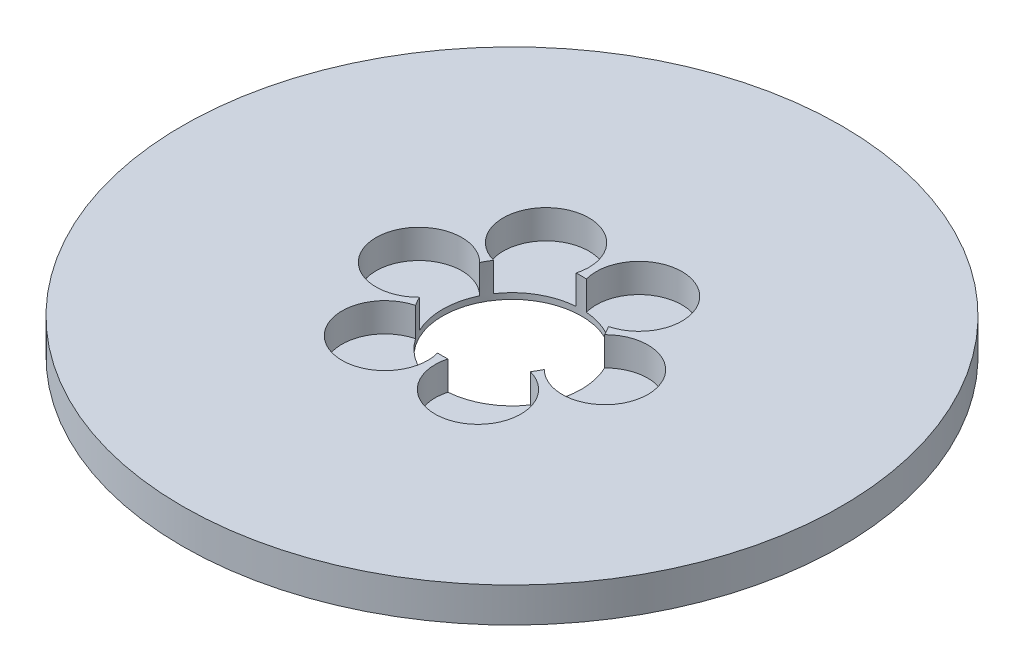
ISO-10303-21;
HEADER;
FILE_DESCRIPTION(('STEP AP214'),'2;1');
FILE_NAME('part.step','',(''),(''),'','','');
FILE_SCHEMA(('AUTOMOTIVE_DESIGN { 1 0 10303 214 1 1 1 1 }'));
ENDSEC;
DATA;
#1=APPLICATION_CONTEXT('core data for automotive mechanical design processes');
#2=APPLICATION_PROTOCOL_DEFINITION('international standard','automotive_design',2000,#1);
#3=PRODUCT_CONTEXT('',#1,'mechanical');
#4=PRODUCT('Part','Part','',(#3));
#5=PRODUCT_RELATED_PRODUCT_CATEGORY('part','',(#4));
#6=PRODUCT_DEFINITION_FORMATION('','',#4);
#7=PRODUCT_DEFINITION_CONTEXT('part definition',#1,'design');
#8=PRODUCT_DEFINITION('design','',#6,#7);
#9=PRODUCT_DEFINITION_SHAPE('','',#8);
#10=(LENGTH_UNIT() NAMED_UNIT(*) SI_UNIT(.MILLI.,.METRE.));
#11=(NAMED_UNIT(*) PLANE_ANGLE_UNIT() SI_UNIT($,.RADIAN.));
#12=(NAMED_UNIT(*) SI_UNIT($,.STERADIAN.) SOLID_ANGLE_UNIT());
#13=UNCERTAINTY_MEASURE_WITH_UNIT(LENGTH_MEASURE(1.E-05),#10,'distance_accuracy_value','');
#14=(GEOMETRIC_REPRESENTATION_CONTEXT(3) GLOBAL_UNCERTAINTY_ASSIGNED_CONTEXT((#13)) GLOBAL_UNIT_ASSIGNED_CONTEXT((#10,
#11,#12)) REPRESENTATION_CONTEXT('',''));
#15=CARTESIAN_POINT('',(0.,0.,0.));
#16=DIRECTION('',(0.,0.,1.));
#17=DIRECTION('',(1.,0.,0.));
#18=AXIS2_PLACEMENT_3D('',#15,#16,#17);
#19=CARTESIAN_POINT('',(0.,5.,0.));
#20=DIRECTION('',(0.,-1.,0.));
#21=DIRECTION('',(0.,0.,-1.));
#22=AXIS2_PLACEMENT_3D('',#19,#20,#21);
#23=CYLINDRICAL_SURFACE('',#22,47.5);
#24=CARTESIAN_POINT('',(0.,5.,0.));
#25=DIRECTION('',(0.,1.,0.));
#26=DIRECTION('',(0.,0.,1.));
#27=AXIS2_PLACEMENT_3D('',#24,#25,#26);
#28=CIRCLE('',#27,47.5);
#29=CARTESIAN_POINT('',(0.,5.,47.5));
#30=VERTEX_POINT('',#29);
#31=EDGE_CURVE('E168',#30,#30,#28,.T.);
#32=ORIENTED_EDGE('',*,*,#31,.F.);
#33=EDGE_LOOP('',(#32));
#34=FACE_BOUND('',#33,.T.);
#35=CARTESIAN_POINT('',(0.,0.,0.));
#36=DIRECTION('',(0.,1.,0.));
#37=DIRECTION('',(0.,0.,1.));
#38=AXIS2_PLACEMENT_3D('',#35,#36,#37);
#39=CIRCLE('',#38,47.5);
#40=CARTESIAN_POINT('',(0.,0.,47.5));
#41=VERTEX_POINT('',#40);
#42=EDGE_CURVE('E158',#41,#41,#39,.T.);
#43=ORIENTED_EDGE('',*,*,#42,.T.);
#44=EDGE_LOOP('',(#43));
#45=FACE_BOUND('',#44,.T.);
#46=ADVANCED_FACE('F39',(#34,#45),#23,.T.);
#47=CARTESIAN_POINT('',(0.,5.,0.));
#48=DIRECTION('',(0.,1.,0.));
#49=DIRECTION('',(0.,0.,1.));
#50=AXIS2_PLACEMENT_3D('',#47,#48,#49);
#51=PLANE('',#50);
#52=CARTESIAN_POINT('',(13.4101402893217,5.,0.));
#53=DIRECTION('',(0.,1.,0.));
#54=DIRECTION('',(0.,0.,-1.));
#55=AXIS2_PLACEMENT_3D('',#52,#53,#54);
#56=CIRCLE('',#55,6.18330857779389);
#57=CARTESIAN_POINT('',(9.0080548151853,5.,4.34222851156143));
#58=VERTEX_POINT('',#57);
#59=CARTESIAN_POINT('',(9.0080548151853,5.,-4.34222851156143));
#60=VERTEX_POINT('',#59);
#61=EDGE_CURVE('E212',#58,#60,#56,.T.);
#62=ORIENTED_EDGE('',*,*,#61,.F.);
#63=CARTESIAN_POINT('',(0.,5.,0.));
#64=DIRECTION('',(0.,1.,0.));
#65=DIRECTION('',(0.,0.,1.));
#66=AXIS2_PLACEMENT_3D('',#63,#64,#65);
#67=CIRCLE('',#66,10.);
#68=CARTESIAN_POINT('',(8.26450760764196,5.,5.63009005285245));
#69=VERTEX_POINT('',#68);
#70=EDGE_CURVE('E156',#69,#58,#67,.T.);
#71=ORIENTED_EDGE('',*,*,#70,.F.);
#72=CARTESIAN_POINT('',(6.70507014466089,5.,11.6135221588657));
#73=DIRECTION('',(0.,1.,0.));
#74=DIRECTION('',(0.866025403784436,0.,-0.500000000000004));
#75=AXIS2_PLACEMENT_3D('',#72,#73,#74);
#76=CIRCLE('',#75,6.18330857779389);
#77=CARTESIAN_POINT('',(0.743547207543411,5.,9.97231856441392));
#78=VERTEX_POINT('',#77);
#79=EDGE_CURVE('E152',#78,#69,#76,.T.);
#80=ORIENTED_EDGE('',*,*,#79,.F.);
#81=CARTESIAN_POINT('',(-0.74354720754334,5.,9.97231856441392));
#82=VERTEX_POINT('',#81);
#83=EDGE_CURVE('E148',#82,#78,#67,.T.);
#84=ORIENTED_EDGE('',*,*,#83,.F.);
#85=CARTESIAN_POINT('',(-6.70507014466081,5.,11.6135221588658));
#86=DIRECTION('',(0.,1.,0.));
#87=DIRECTION('',(0.86602540378444,0.,0.499999999999998));
#88=AXIS2_PLACEMENT_3D('',#85,#86,#87);
#89=CIRCLE('',#88,6.18330857779389);
#90=CARTESIAN_POINT('',(-8.26450760764192,5.,5.63009005285251));
#91=VERTEX_POINT('',#90);
#92=EDGE_CURVE('E127',#91,#82,#89,.T.);
#93=ORIENTED_EDGE('',*,*,#92,.F.);
#94=CARTESIAN_POINT('',(-9.0080548151853,5.,4.34222851156143));
#95=VERTEX_POINT('',#94);
#96=EDGE_CURVE('E154',#95,#91,#67,.T.);
#97=ORIENTED_EDGE('',*,*,#96,.F.);
#98=CARTESIAN_POINT('',(-13.4101402893217,5.,0.));
#99=DIRECTION('',(0.,1.,0.));
#100=DIRECTION('',(0.,0.,1.));
#101=AXIS2_PLACEMENT_3D('',#98,#99,#100);
#102=CIRCLE('',#101,6.18330857779389);
#103=CARTESIAN_POINT('',(-9.0080548151853,5.,-4.34222851156143));
#104=VERTEX_POINT('',#103);
#105=EDGE_CURVE('E163',#104,#95,#102,.T.);
#106=ORIENTED_EDGE('',*,*,#105,.F.);
#107=CARTESIAN_POINT('',(-8.264507607642,5.,-5.6300900528524));
#108=VERTEX_POINT('',#107);
#109=EDGE_CURVE('E157',#108,#104,#67,.T.);
#110=ORIENTED_EDGE('',*,*,#109,.F.);
#111=CARTESIAN_POINT('',(-6.70507014466097,5.,-11.6135221588657));
#112=DIRECTION('',(0.,1.,0.));
#113=DIRECTION('',(-0.866025403784433,0.,0.50000000000001));
#114=AXIS2_PLACEMENT_3D('',#111,#112,#113);
#115=CIRCLE('',#114,6.18330857779389);
#116=CARTESIAN_POINT('',(-0.743547207543479,5.,-9.97231856441391));
#117=VERTEX_POINT('',#116);
#118=EDGE_CURVE('E371',#117,#108,#115,.T.);
#119=ORIENTED_EDGE('',*,*,#118,.F.);
#120=CARTESIAN_POINT('',(0.743547207543271,5.,-9.97231856441393));
#121=VERTEX_POINT('',#120);
#122=EDGE_CURVE('E378',#121,#117,#67,.T.);
#123=ORIENTED_EDGE('',*,*,#122,.F.);
#124=CARTESIAN_POINT('',(6.70507014466073,5.,-11.6135221588658));
#125=DIRECTION('',(0.,1.,0.));
#126=DIRECTION('',(-0.866025403784443,0.,-0.499999999999992));
#127=AXIS2_PLACEMENT_3D('',#124,#125,#126);
#128=CIRCLE('',#127,6.18330857779389);
#129=CARTESIAN_POINT('',(8.26450760764188,5.,-5.63009005285257));
#130=VERTEX_POINT('',#129);
#131=EDGE_CURVE('E392',#130,#121,#128,.T.);
#132=ORIENTED_EDGE('',*,*,#131,.F.);
#133=EDGE_CURVE('E161',#60,#130,#67,.T.);
#134=ORIENTED_EDGE('',*,*,#133,.F.);
#135=EDGE_LOOP('',(#62,#71,#80,#84,#93,#97,#106,#110,#119,#123,#132,#134));
#136=FACE_BOUND('',#135,.T.);
#137=ORIENTED_EDGE('',*,*,#31,.T.);
#138=EDGE_LOOP('',(#137));
#139=FACE_BOUND('',#138,.T.);
#140=ADVANCED_FACE('F151',(#136,#139),#51,.T.);
#141=CARTESIAN_POINT('',(0.,0.,0.));
#142=DIRECTION('',(0.,1.,0.));
#143=DIRECTION('',(0.,0.,1.));
#144=AXIS2_PLACEMENT_3D('',#141,#142,#143);
#145=PLANE('',#144);
#146=CARTESIAN_POINT('',(0.,0.,0.));
#147=DIRECTION('',(0.,1.,0.));
#148=DIRECTION('',(0.,0.,1.));
#149=AXIS2_PLACEMENT_3D('',#146,#147,#148);
#150=CIRCLE('',#149,10.);
#151=CARTESIAN_POINT('',(0.,0.,10.));
#152=VERTEX_POINT('',#151);
#153=EDGE_CURVE('E167',#152,#152,#150,.T.);
#154=ORIENTED_EDGE('',*,*,#153,.T.);
#155=EDGE_LOOP('',(#154));
#156=FACE_BOUND('',#155,.T.);
#157=ORIENTED_EDGE('',*,*,#42,.F.);
#158=EDGE_LOOP('',(#157));
#159=FACE_BOUND('',#158,.T.);
#160=ADVANCED_FACE('F235',(#156,#159),#145,.F.);
#161=CARTESIAN_POINT('',(0.,5.,0.));
#162=DIRECTION('',(0.,-1.,0.));
#163=DIRECTION('',(0.,0.,-1.));
#164=AXIS2_PLACEMENT_3D('',#161,#162,#163);
#165=CYLINDRICAL_SURFACE('',#164,10.);
#166=DIRECTION('',(0.,1.,0.));
#167=VECTOR('',#166,1.);
#168=CARTESIAN_POINT('',(9.0080548151853,2.92207011488759,4.34222851156143));
#169=LINE('',#168,#167);
#170=CARTESIAN_POINT('',(9.0080548151853,0.84414022977518,4.34222851156143));
#171=VERTEX_POINT('',#170);
#172=EDGE_CURVE('E11',#171,#58,#169,.T.);
#173=ORIENTED_EDGE('',*,*,#172,.F.);
#174=CARTESIAN_POINT('',(0.,0.84414022977518,0.));
#175=DIRECTION('',(0.,1.,0.));
#176=DIRECTION('',(0.,0.,1.));
#177=AXIS2_PLACEMENT_3D('',#174,#175,#176);
#178=CIRCLE('',#177,10.);
#179=CARTESIAN_POINT('',(9.0080548151853,0.84414022977518,-4.34222851156143));
#180=VERTEX_POINT('',#179);
#181=EDGE_CURVE('E207',#171,#180,#178,.T.);
#182=ORIENTED_EDGE('',*,*,#181,.T.);
#183=DIRECTION('',(0.,1.,0.));
#184=VECTOR('',#183,1.);
#185=CARTESIAN_POINT('',(9.0080548151853,2.92207011488759,-4.34222851156143));
#186=LINE('',#185,#184);
#187=EDGE_CURVE('E46',#60,#180,#186,.F.);
#188=ORIENTED_EDGE('',*,*,#187,.F.);
#189=ORIENTED_EDGE('',*,*,#133,.T.);
#190=DIRECTION('',(0.,1.,0.));
#191=VECTOR('',#190,1.);
#192=CARTESIAN_POINT('',(8.26450760764188,2.92207011488759,-5.63009005285257));
#193=LINE('',#192,#191);
#194=CARTESIAN_POINT('',(8.26450760764188,0.84414022977518,-5.63009005285257));
#195=VERTEX_POINT('',#194);
#196=EDGE_CURVE('E199',#195,#130,#193,.T.);
#197=ORIENTED_EDGE('',*,*,#196,.F.);
#198=CARTESIAN_POINT('',(0.,0.84414022977518,0.));
#199=DIRECTION('',(0.,1.,0.));
#200=DIRECTION('',(0.,0.,1.));
#201=AXIS2_PLACEMENT_3D('',#198,#199,#200);
#202=CIRCLE('',#201,10.);
#203=CARTESIAN_POINT('',(0.743547207543271,0.84414022977518,-9.97231856441393));
#204=VERTEX_POINT('',#203);
#205=EDGE_CURVE('E193',#195,#204,#202,.T.);
#206=ORIENTED_EDGE('',*,*,#205,.T.);
#207=DIRECTION('',(0.,1.,0.));
#208=VECTOR('',#207,1.);
#209=CARTESIAN_POINT('',(0.743547207543271,2.92207011488759,-9.97231856441392));
#210=LINE('',#209,#208);
#211=EDGE_CURVE('E197',#121,#204,#210,.F.);
#212=ORIENTED_EDGE('',*,*,#211,.F.);
#213=ORIENTED_EDGE('',*,*,#122,.T.);
#214=DIRECTION('',(0.,1.,0.));
#215=VECTOR('',#214,1.);
#216=CARTESIAN_POINT('',(-0.74354720754348,2.92207011488759,-9.97231856441391));
#217=LINE('',#216,#215);
#218=CARTESIAN_POINT('',(-0.743547207543479,0.84414022977518,-9.97231856441391));
#219=VERTEX_POINT('',#218);
#220=EDGE_CURVE('E195',#219,#117,#217,.T.);
#221=ORIENTED_EDGE('',*,*,#220,.F.);
#222=CARTESIAN_POINT('',(0.,0.84414022977518,0.));
#223=DIRECTION('',(0.,1.,0.));
#224=DIRECTION('',(0.,0.,1.));
#225=AXIS2_PLACEMENT_3D('',#222,#223,#224);
#226=CIRCLE('',#225,10.);
#227=CARTESIAN_POINT('',(-8.264507607642,0.84414022977518,-5.6300900528524));
#228=VERTEX_POINT('',#227);
#229=EDGE_CURVE('E186',#219,#228,#226,.T.);
#230=ORIENTED_EDGE('',*,*,#229,.T.);
#231=DIRECTION('',(0.,1.,0.));
#232=VECTOR('',#231,1.);
#233=CARTESIAN_POINT('',(-8.264507607642,2.92207011488759,-5.6300900528524));
#234=LINE('',#233,#232);
#235=EDGE_CURVE('E188',#108,#228,#234,.F.);
#236=ORIENTED_EDGE('',*,*,#235,.F.);
#237=ORIENTED_EDGE('',*,*,#109,.T.);
#238=DIRECTION('',(0.,1.,0.));
#239=VECTOR('',#238,1.);
#240=CARTESIAN_POINT('',(-9.0080548151853,2.92207011488759,-4.34222851156143));
#241=LINE('',#240,#239);
#242=CARTESIAN_POINT('',(-9.0080548151853,0.84414022977518,-4.34222851156143));
#243=VERTEX_POINT('',#242);
#244=EDGE_CURVE('E182',#243,#104,#241,.T.);
#245=ORIENTED_EDGE('',*,*,#244,.F.);
#246=CARTESIAN_POINT('',(0.,0.84414022977518,0.));
#247=DIRECTION('',(0.,1.,0.));
#248=DIRECTION('',(0.,0.,1.));
#249=AXIS2_PLACEMENT_3D('',#246,#247,#248);
#250=CIRCLE('',#249,10.);
#251=CARTESIAN_POINT('',(-9.0080548151853,0.84414022977518,4.34222851156143));
#252=VERTEX_POINT('',#251);
#253=EDGE_CURVE('E172',#243,#252,#250,.T.);
#254=ORIENTED_EDGE('',*,*,#253,.T.);
#255=DIRECTION('',(0.,1.,0.));
#256=VECTOR('',#255,1.);
#257=CARTESIAN_POINT('',(-9.0080548151853,2.92207011488759,4.34222851156143));
#258=LINE('',#257,#256);
#259=EDGE_CURVE('E177',#95,#252,#258,.F.);
#260=ORIENTED_EDGE('',*,*,#259,.F.);
#261=ORIENTED_EDGE('',*,*,#96,.T.);
#262=DIRECTION('',(0.,1.,0.));
#263=VECTOR('',#262,1.);
#264=CARTESIAN_POINT('',(-8.26450760764192,2.92207011488759,5.63009005285251));
#265=LINE('',#264,#263);
#266=CARTESIAN_POINT('',(-8.26450760764192,0.84414022977518,5.63009005285251));
#267=VERTEX_POINT('',#266);
#268=EDGE_CURVE('E132',#267,#91,#265,.T.);
#269=ORIENTED_EDGE('',*,*,#268,.F.);
#270=CARTESIAN_POINT('',(0.,0.84414022977518,0.));
#271=DIRECTION('',(0.,1.,0.));
#272=DIRECTION('',(0.,0.,1.));
#273=AXIS2_PLACEMENT_3D('',#270,#271,#272);
#274=CIRCLE('',#273,10.);
#275=CARTESIAN_POINT('',(-0.74354720754334,0.84414022977518,9.97231856441392));
#276=VERTEX_POINT('',#275);
#277=EDGE_CURVE('E150',#267,#276,#274,.T.);
#278=ORIENTED_EDGE('',*,*,#277,.T.);
#279=DIRECTION('',(0.,1.,0.));
#280=VECTOR('',#279,1.);
#281=CARTESIAN_POINT('',(-0.74354720754334,2.92207011488759,9.97231856441392));
#282=LINE('',#281,#280);
#283=EDGE_CURVE('E128',#82,#276,#282,.F.);
#284=ORIENTED_EDGE('',*,*,#283,.F.);
#285=ORIENTED_EDGE('',*,*,#83,.T.);
#286=DIRECTION('',(0.,1.,0.));
#287=VECTOR('',#286,1.);
#288=CARTESIAN_POINT('',(0.743547207543411,2.92207011488759,9.97231856441391));
#289=LINE('',#288,#287);
#290=CARTESIAN_POINT('',(0.743547207543411,0.84414022977518,9.97231856441392));
#291=VERTEX_POINT('',#290);
#292=EDGE_CURVE('E210',#291,#78,#289,.T.);
#293=ORIENTED_EDGE('',*,*,#292,.F.);
#294=CARTESIAN_POINT('',(0.,0.84414022977518,0.));
#295=DIRECTION('',(0.,1.,0.));
#296=DIRECTION('',(0.,0.,1.));
#297=AXIS2_PLACEMENT_3D('',#294,#295,#296);
#298=CIRCLE('',#297,10.);
#299=CARTESIAN_POINT('',(8.26450760764196,0.84414022977518,5.63009005285245));
#300=VERTEX_POINT('',#299);
#301=EDGE_CURVE('E205',#291,#300,#298,.T.);
#302=ORIENTED_EDGE('',*,*,#301,.T.);
#303=DIRECTION('',(0.,1.,0.));
#304=VECTOR('',#303,1.);
#305=CARTESIAN_POINT('',(8.26450760764196,2.92207011488759,5.63009005285245));
#306=LINE('',#305,#304);
#307=EDGE_CURVE('E202',#69,#300,#306,.F.);
#308=ORIENTED_EDGE('',*,*,#307,.F.);
#309=ORIENTED_EDGE('',*,*,#70,.T.);
#310=EDGE_LOOP('',(#173,#182,#188,#189,#197,#206,#212,#213,#221,#230,#236,#237,#245,#254,#260,
#261,#269,#278,#284,#285,#293,#302,#308,#309));
#311=FACE_BOUND('',#310,.T.);
#312=ORIENTED_EDGE('',*,*,#153,.F.);
#313=EDGE_LOOP('',(#312));
#314=FACE_BOUND('',#313,.T.);
#315=ADVANCED_FACE('F141',(#311,#314),#165,.F.);
#316=CARTESIAN_POINT('',(-13.4101402893217,0.84414022977518,0.));
#317=DIRECTION('',(0.,1.,0.));
#318=DIRECTION('',(0.,0.,1.));
#319=AXIS2_PLACEMENT_3D('',#316,#317,#318);
#320=CYLINDRICAL_SURFACE('',#319,6.18330857779389);
#321=ORIENTED_EDGE('',*,*,#244,.T.);
#322=ORIENTED_EDGE('',*,*,#105,.T.);
#323=ORIENTED_EDGE('',*,*,#259,.T.);
#324=CARTESIAN_POINT('',(-13.4101402893217,0.84414022977518,0.));
#325=DIRECTION('',(0.,1.,0.));
#326=DIRECTION('',(0.,0.,1.));
#327=AXIS2_PLACEMENT_3D('',#324,#325,#326);
#328=CIRCLE('',#327,6.18330857779389);
#329=EDGE_CURVE('E166',#243,#252,#328,.T.);
#330=ORIENTED_EDGE('',*,*,#329,.F.);
#331=EDGE_LOOP('',(#321,#322,#323,#330));
#332=FACE_BOUND('',#331,.T.);
#333=ADVANCED_FACE('F242',(#332),#320,.F.);
#334=CARTESIAN_POINT('',(-13.4101402893217,0.84414022977518,0.));
#335=DIRECTION('',(0.,1.,0.));
#336=DIRECTION('',(0.,0.,1.));
#337=AXIS2_PLACEMENT_3D('',#334,#335,#336);
#338=PLANE('',#337);
#339=ORIENTED_EDGE('',*,*,#329,.T.);
#340=ORIENTED_EDGE('',*,*,#253,.F.);
#341=EDGE_LOOP('',(#339,#340));
#342=FACE_BOUND('',#341,.T.);
#343=ADVANCED_FACE('F250',(#342),#338,.T.);
#344=CARTESIAN_POINT('',(-6.70507014466081,0.84414022977518,11.6135221588658));
#345=DIRECTION('',(0.,1.,0.));
#346=DIRECTION('',(0.,0.,1.));
#347=AXIS2_PLACEMENT_3D('',#344,#345,#346);
#348=CYLINDRICAL_SURFACE('',#347,6.18330857779389);
#349=ORIENTED_EDGE('',*,*,#268,.T.);
#350=ORIENTED_EDGE('',*,*,#92,.T.);
#351=ORIENTED_EDGE('',*,*,#283,.T.);
#352=CARTESIAN_POINT('',(-6.70507014466081,0.84414022977518,11.6135221588658));
#353=DIRECTION('',(0.,1.,0.));
#354=DIRECTION('',(0.86602540378444,0.,0.499999999999998));
#355=AXIS2_PLACEMENT_3D('',#352,#353,#354);
#356=CIRCLE('',#355,6.18330857779389);
#357=EDGE_CURVE('E137',#267,#276,#356,.T.);
#358=ORIENTED_EDGE('',*,*,#357,.F.);
#359=EDGE_LOOP('',(#349,#350,#351,#358));
#360=FACE_BOUND('',#359,.T.);
#361=ADVANCED_FACE('F126',(#360),#348,.F.);
#362=CARTESIAN_POINT('',(-6.70507014466081,0.84414022977518,11.6135221588658));
#363=DIRECTION('',(0.,1.,0.));
#364=DIRECTION('',(0.86602540378444,0.,0.499999999999998));
#365=AXIS2_PLACEMENT_3D('',#362,#363,#364);
#366=PLANE('',#365);
#367=ORIENTED_EDGE('',*,*,#357,.T.);
#368=ORIENTED_EDGE('',*,*,#277,.F.);
#369=EDGE_LOOP('',(#367,#368));
#370=FACE_BOUND('',#369,.T.);
#371=ADVANCED_FACE('F255',(#370),#366,.T.);
#372=CARTESIAN_POINT('',(-6.70507014466097,0.84414022977518,-11.6135221588657));
#373=DIRECTION('',(0.,1.,0.));
#374=DIRECTION('',(0.,0.,1.));
#375=AXIS2_PLACEMENT_3D('',#372,#373,#374);
#376=CYLINDRICAL_SURFACE('',#375,6.18330857779389);
#377=ORIENTED_EDGE('',*,*,#220,.T.);
#378=ORIENTED_EDGE('',*,*,#118,.T.);
#379=ORIENTED_EDGE('',*,*,#235,.T.);
#380=CARTESIAN_POINT('',(-6.70507014466097,0.84414022977518,-11.6135221588657));
#381=DIRECTION('',(0.,1.,0.));
#382=DIRECTION('',(-0.866025403784433,0.,0.50000000000001));
#383=AXIS2_PLACEMENT_3D('',#380,#381,#382);
#384=CIRCLE('',#383,6.18330857779389);
#385=EDGE_CURVE('E373',#219,#228,#384,.T.);
#386=ORIENTED_EDGE('',*,*,#385,.F.);
#387=EDGE_LOOP('',(#377,#378,#379,#386));
#388=FACE_BOUND('',#387,.T.);
#389=ADVANCED_FACE('F260',(#388),#376,.F.);
#390=CARTESIAN_POINT('',(-6.70507014466097,0.84414022977518,-11.6135221588657));
#391=DIRECTION('',(0.,1.,0.));
#392=DIRECTION('',(-0.866025403784433,0.,0.50000000000001));
#393=AXIS2_PLACEMENT_3D('',#390,#391,#392);
#394=PLANE('',#393);
#395=ORIENTED_EDGE('',*,*,#385,.T.);
#396=ORIENTED_EDGE('',*,*,#229,.F.);
#397=EDGE_LOOP('',(#395,#396));
#398=FACE_BOUND('',#397,.T.);
#399=ADVANCED_FACE('F301',(#398),#394,.T.);
#400=CARTESIAN_POINT('',(6.70507014466073,0.84414022977518,-11.6135221588658));
#401=DIRECTION('',(0.,1.,0.));
#402=DIRECTION('',(0.,0.,1.));
#403=AXIS2_PLACEMENT_3D('',#400,#401,#402);
#404=CYLINDRICAL_SURFACE('',#403,6.18330857779389);
#405=ORIENTED_EDGE('',*,*,#196,.T.);
#406=ORIENTED_EDGE('',*,*,#131,.T.);
#407=ORIENTED_EDGE('',*,*,#211,.T.);
#408=CARTESIAN_POINT('',(6.70507014466073,0.84414022977518,-11.6135221588658));
#409=DIRECTION('',(0.,1.,0.));
#410=DIRECTION('',(-0.866025403784443,0.,-0.499999999999992));
#411=AXIS2_PLACEMENT_3D('',#408,#409,#410);
#412=CIRCLE('',#411,6.18330857779389);
#413=EDGE_CURVE('E388',#195,#204,#412,.T.);
#414=ORIENTED_EDGE('',*,*,#413,.F.);
#415=EDGE_LOOP('',(#405,#406,#407,#414));
#416=FACE_BOUND('',#415,.T.);
#417=ADVANCED_FACE('F295',(#416),#404,.F.);
#418=CARTESIAN_POINT('',(6.70507014466073,0.84414022977518,-11.6135221588658));
#419=DIRECTION('',(0.,1.,0.));
#420=DIRECTION('',(-0.866025403784443,0.,-0.499999999999992));
#421=AXIS2_PLACEMENT_3D('',#418,#419,#420);
#422=PLANE('',#421);
#423=ORIENTED_EDGE('',*,*,#413,.T.);
#424=ORIENTED_EDGE('',*,*,#205,.F.);
#425=EDGE_LOOP('',(#423,#424));
#426=FACE_BOUND('',#425,.T.);
#427=ADVANCED_FACE('F265',(#426),#422,.T.);
#428=CARTESIAN_POINT('',(6.70507014466089,0.84414022977518,11.6135221588657));
#429=DIRECTION('',(0.,1.,0.));
#430=DIRECTION('',(0.,0.,1.));
#431=AXIS2_PLACEMENT_3D('',#428,#429,#430);
#432=CYLINDRICAL_SURFACE('',#431,6.18330857779389);
#433=ORIENTED_EDGE('',*,*,#292,.T.);
#434=ORIENTED_EDGE('',*,*,#79,.T.);
#435=ORIENTED_EDGE('',*,*,#307,.T.);
#436=CARTESIAN_POINT('',(6.70507014466089,0.84414022977518,11.6135221588657));
#437=DIRECTION('',(0.,1.,0.));
#438=DIRECTION('',(0.866025403784436,0.,-0.500000000000004));
#439=AXIS2_PLACEMENT_3D('',#436,#437,#438);
#440=CIRCLE('',#439,6.18330857779389);
#441=EDGE_CURVE('E56',#291,#300,#440,.T.);
#442=ORIENTED_EDGE('',*,*,#441,.F.);
#443=EDGE_LOOP('',(#433,#434,#435,#442));
#444=FACE_BOUND('',#443,.T.);
#445=ADVANCED_FACE('F259',(#444),#432,.F.);
#446=CARTESIAN_POINT('',(6.70507014466089,0.84414022977518,11.6135221588657));
#447=DIRECTION('',(0.,1.,0.));
#448=DIRECTION('',(0.866025403784436,0.,-0.500000000000004));
#449=AXIS2_PLACEMENT_3D('',#446,#447,#448);
#450=PLANE('',#449);
#451=ORIENTED_EDGE('',*,*,#441,.T.);
#452=ORIENTED_EDGE('',*,*,#301,.F.);
#453=EDGE_LOOP('',(#451,#452));
#454=FACE_BOUND('',#453,.T.);
#455=ADVANCED_FACE('F224',(#454),#450,.T.);
#456=CARTESIAN_POINT('',(13.4101402893217,0.84414022977518,0.));
#457=DIRECTION('',(0.,1.,0.));
#458=DIRECTION('',(0.,0.,1.));
#459=AXIS2_PLACEMENT_3D('',#456,#457,#458);
#460=CYLINDRICAL_SURFACE('',#459,6.18330857779389);
#461=ORIENTED_EDGE('',*,*,#172,.T.);
#462=ORIENTED_EDGE('',*,*,#61,.T.);
#463=ORIENTED_EDGE('',*,*,#187,.T.);
#464=CARTESIAN_POINT('',(13.4101402893217,0.84414022977518,0.));
#465=DIRECTION('',(0.,1.,0.));
#466=DIRECTION('',(0.,0.,-1.));
#467=AXIS2_PLACEMENT_3D('',#464,#465,#466);
#468=CIRCLE('',#467,6.18330857779389);
#469=EDGE_CURVE('E55',#171,#180,#468,.T.);
#470=ORIENTED_EDGE('',*,*,#469,.F.);
#471=EDGE_LOOP('',(#461,#462,#463,#470));
#472=FACE_BOUND('',#471,.T.);
#473=ADVANCED_FACE('F213',(#472),#460,.F.);
#474=CARTESIAN_POINT('',(13.4101402893217,0.84414022977518,0.));
#475=DIRECTION('',(0.,1.,0.));
#476=DIRECTION('',(0.,0.,-1.));
#477=AXIS2_PLACEMENT_3D('',#474,#475,#476);
#478=PLANE('',#477);
#479=ORIENTED_EDGE('',*,*,#469,.T.);
#480=ORIENTED_EDGE('',*,*,#181,.F.);
#481=EDGE_LOOP('',(#479,#480));
#482=FACE_BOUND('',#481,.T.);
#483=ADVANCED_FACE('F220',(#482),#478,.T.);
#484=CLOSED_SHELL('',(#46,#140,#160,#315,#333,#343,#361,#371,#389,#399,#417,#427,#445,#455,#473,#483));
#485=MANIFOLD_SOLID_BREP('B2',#484);
#486=ADVANCED_BREP_SHAPE_REPRESENTATION('',(#18,#485),#14);
#487=SHAPE_DEFINITION_REPRESENTATION(#9,#486);
ENDSEC;
END-ISO-10303-21;
